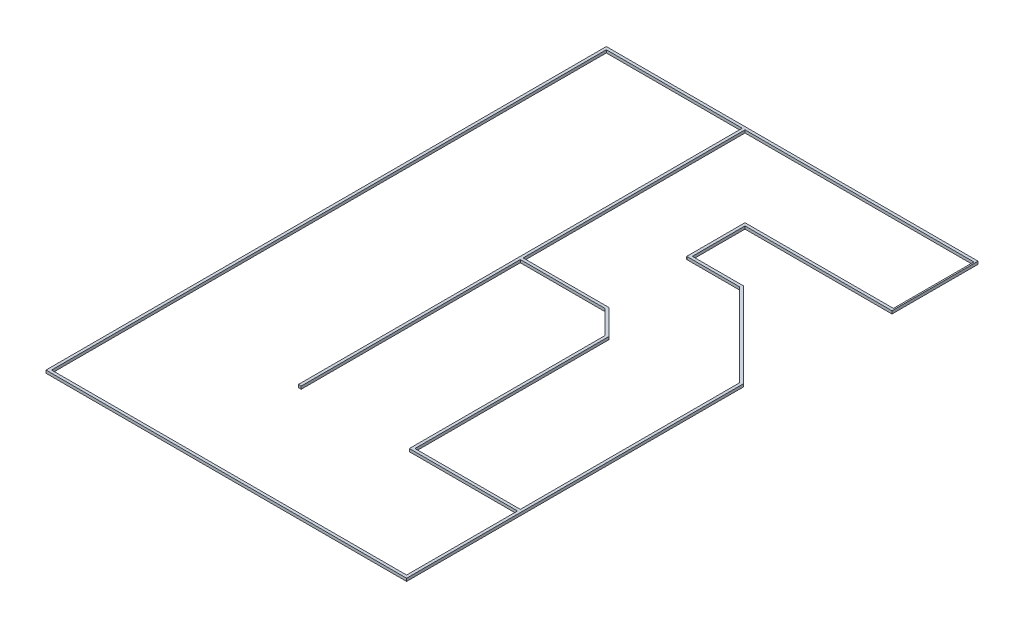
ISO-10303-21;
HEADER;
FILE_DESCRIPTION(('STEP AP214'),'2;1');
FILE_NAME('part.step','',(''),(''),'','','');
FILE_SCHEMA(('AUTOMOTIVE_DESIGN { 1 0 10303 214 1 1 1 1 }'));
ENDSEC;
DATA;
#1=APPLICATION_CONTEXT('core data for automotive mechanical design processes');
#2=APPLICATION_PROTOCOL_DEFINITION('international standard','automotive_design',2000,#1);
#3=PRODUCT_CONTEXT('',#1,'mechanical');
#4=PRODUCT('Part','Part','',(#3));
#5=PRODUCT_RELATED_PRODUCT_CATEGORY('part','',(#4));
#6=PRODUCT_DEFINITION_FORMATION('','',#4);
#7=PRODUCT_DEFINITION_CONTEXT('part definition',#1,'design');
#8=PRODUCT_DEFINITION('design','',#6,#7);
#9=PRODUCT_DEFINITION_SHAPE('','',#8);
#10=(LENGTH_UNIT() NAMED_UNIT(*) SI_UNIT(.MILLI.,.METRE.));
#11=(NAMED_UNIT(*) PLANE_ANGLE_UNIT() SI_UNIT($,.RADIAN.));
#12=(NAMED_UNIT(*) SI_UNIT($,.STERADIAN.) SOLID_ANGLE_UNIT());
#13=UNCERTAINTY_MEASURE_WITH_UNIT(LENGTH_MEASURE(1.E-05),#10,'distance_accuracy_value','');
#14=(GEOMETRIC_REPRESENTATION_CONTEXT(3) GLOBAL_UNCERTAINTY_ASSIGNED_CONTEXT((#13)) GLOBAL_UNIT_ASSIGNED_CONTEXT((#10,
#11,#12)) REPRESENTATION_CONTEXT('',''));
#15=CARTESIAN_POINT('',(0.,0.,0.));
#16=DIRECTION('',(0.,0.,1.));
#17=DIRECTION('',(1.,0.,0.));
#18=AXIS2_PLACEMENT_3D('',#15,#16,#17);
#19=CARTESIAN_POINT('',(0.,50.8,0.));
#20=DIRECTION('',(1.,0.,0.));
#21=DIRECTION('',(0.,0.,-1.));
#22=AXIS2_PLACEMENT_3D('',#19,#20,#21);
#23=PLANE('',#22);
#24=DIRECTION('',(0.,0.,1.));
#25=VECTOR('',#24,1.);
#26=CARTESIAN_POINT('',(0.,0.,0.));
#27=LINE('',#26,#25);
#28=CARTESIAN_POINT('',(0.,0.,-8170.51458234219));
#29=VERTEX_POINT('',#28);
#30=CARTESIAN_POINT('',(2.94505117041419E-13,0.,-6720.51458234219));
#31=VERTEX_POINT('',#30);
#32=EDGE_CURVE('E566',#29,#31,#27,.T.);
#33=ORIENTED_EDGE('',*,*,#32,.T.);
#34=DIRECTION('',(0.,-1.,0.));
#35=VECTOR('',#34,1.);
#36=CARTESIAN_POINT('',(2.94505117041419E-13,50.8,-6720.51458234219));
#37=LINE('',#36,#35);
#38=CARTESIAN_POINT('',(2.94505117041419E-13,50.8,-6720.51458234219));
#39=VERTEX_POINT('',#38);
#40=EDGE_CURVE('E11',#39,#31,#37,.T.);
#41=ORIENTED_EDGE('',*,*,#40,.F.);
#42=DIRECTION('',(0.,0.,1.));
#43=VECTOR('',#42,1.);
#44=CARTESIAN_POINT('',(0.,50.8,0.));
#45=LINE('',#44,#43);
#46=CARTESIAN_POINT('',(0.,50.8,-8170.51458234219));
#47=VERTEX_POINT('',#46);
#48=EDGE_CURVE('E398',#47,#39,#45,.T.);
#49=ORIENTED_EDGE('',*,*,#48,.F.);
#50=DIRECTION('',(0.,-1.,0.));
#51=VECTOR('',#50,1.);
#52=CARTESIAN_POINT('',(0.,50.8,-8170.51458234219));
#53=LINE('',#52,#51);
#54=EDGE_CURVE('E61',#47,#29,#53,.T.);
#55=ORIENTED_EDGE('',*,*,#54,.T.);
#56=EDGE_LOOP('',(#33,#41,#49,#55));
#57=FACE_BOUND('',#56,.T.);
#58=ADVANCED_FACE('F41',(#57),#23,.F.);
#59=CARTESIAN_POINT('',(0.,50.8,-6720.51458234219));
#60=DIRECTION('',(0.,0.,-1.));
#61=DIRECTION('',(-1.,0.,0.));
#62=AXIS2_PLACEMENT_3D('',#59,#60,#61);
#63=PLANE('',#62);
#64=DIRECTION('',(1.,0.,0.));
#65=VECTOR('',#64,1.);
#66=CARTESIAN_POINT('',(0.,0.,-6720.51458234219));
#67=LINE('',#66,#65);
#68=CARTESIAN_POINT('',(-2675.,0.,-6720.51458234219));
#69=VERTEX_POINT('',#68);
#70=EDGE_CURVE('E562',#69,#31,#67,.T.);
#71=ORIENTED_EDGE('',*,*,#70,.F.);
#72=DIRECTION('',(0.,-1.,0.));
#73=VECTOR('',#72,1.);
#74=CARTESIAN_POINT('',(-2675.,50.8,-6720.51458234219));
#75=LINE('',#74,#73);
#76=CARTESIAN_POINT('',(-2675.,50.8,-6720.51458234219));
#77=VERTEX_POINT('',#76);
#78=EDGE_CURVE('E52',#77,#69,#75,.T.);
#79=ORIENTED_EDGE('',*,*,#78,.F.);
#80=DIRECTION('',(1.,0.,0.));
#81=VECTOR('',#80,1.);
#82=CARTESIAN_POINT('',(0.,50.8,-6720.51458234219));
#83=LINE('',#82,#81);
#84=EDGE_CURVE('E394',#77,#39,#83,.T.);
#85=ORIENTED_EDGE('',*,*,#84,.T.);
#86=ORIENTED_EDGE('',*,*,#40,.T.);
#87=EDGE_LOOP('',(#71,#79,#85,#86));
#88=FACE_BOUND('',#87,.T.);
#89=ADVANCED_FACE('F645',(#88),#63,.T.);
#90=CARTESIAN_POINT('',(-2675.,50.8,0.));
#91=DIRECTION('',(-1.,0.,0.));
#92=DIRECTION('',(0.,0.,1.));
#93=AXIS2_PLACEMENT_3D('',#90,#91,#92);
#94=PLANE('',#93);
#95=DIRECTION('',(0.,0.,-1.));
#96=VECTOR('',#95,1.);
#97=CARTESIAN_POINT('',(-2675.,0.,0.));
#98=LINE('',#97,#96);
#99=CARTESIAN_POINT('',(-2675.,0.,-5670.51458234219));
#100=VERTEX_POINT('',#99);
#101=EDGE_CURVE('E558',#100,#69,#98,.T.);
#102=ORIENTED_EDGE('',*,*,#101,.F.);
#103=DIRECTION('',(0.,-1.,0.));
#104=VECTOR('',#103,1.);
#105=CARTESIAN_POINT('',(-2675.,50.8,-5670.51458234219));
#106=LINE('',#105,#104);
#107=CARTESIAN_POINT('',(-2675.,50.8,-5670.51458234219));
#108=VERTEX_POINT('',#107);
#109=EDGE_CURVE('E512',#108,#100,#106,.T.);
#110=ORIENTED_EDGE('',*,*,#109,.F.);
#111=DIRECTION('',(0.,0.,-1.));
#112=VECTOR('',#111,1.);
#113=CARTESIAN_POINT('',(-2675.,50.8,0.));
#114=LINE('',#113,#112);
#115=EDGE_CURVE('E390',#108,#77,#114,.T.);
#116=ORIENTED_EDGE('',*,*,#115,.T.);
#117=ORIENTED_EDGE('',*,*,#78,.T.);
#118=EDGE_LOOP('',(#102,#110,#116,#117));
#119=FACE_BOUND('',#118,.T.);
#120=ADVANCED_FACE('F650',(#119),#94,.T.);
#121=CARTESIAN_POINT('',(-5.30150387434863E-12,50.8,-5670.51458234219));
#122=DIRECTION('',(0.,0.,1.));
#123=DIRECTION('',(1.,0.,0.));
#124=AXIS2_PLACEMENT_3D('',#121,#122,#123);
#125=PLANE('',#124);
#126=DIRECTION('',(-1.,0.,0.));
#127=VECTOR('',#126,1.);
#128=CARTESIAN_POINT('',(-5.30150387434863E-12,0.,-5670.51458234219));
#129=LINE('',#128,#127);
#130=CARTESIAN_POINT('',(-1725.,0.,-5670.51458234219));
#131=VERTEX_POINT('',#130);
#132=EDGE_CURVE('E554',#131,#100,#129,.T.);
#133=ORIENTED_EDGE('',*,*,#132,.F.);
#134=DIRECTION('',(0.,-1.,0.));
#135=VECTOR('',#134,1.);
#136=CARTESIAN_POINT('',(-1725.,50.8,-5670.51458234219));
#137=LINE('',#136,#135);
#138=CARTESIAN_POINT('',(-1725.,50.8,-5670.51458234219));
#139=VERTEX_POINT('',#138);
#140=EDGE_CURVE('E515',#139,#131,#137,.T.);
#141=ORIENTED_EDGE('',*,*,#140,.F.);
#142=DIRECTION('',(-1.,0.,0.));
#143=VECTOR('',#142,1.);
#144=CARTESIAN_POINT('',(-5.30150387434863E-12,50.8,-5670.51458234219));
#145=LINE('',#144,#143);
#146=EDGE_CURVE('E386',#139,#108,#145,.T.);
#147=ORIENTED_EDGE('',*,*,#146,.T.);
#148=ORIENTED_EDGE('',*,*,#109,.T.);
#149=EDGE_LOOP('',(#133,#141,#147,#148));
#150=FACE_BOUND('',#149,.T.);
#151=ADVANCED_FACE('F727',(#150),#125,.T.);
#152=CARTESIAN_POINT('',(1972.7572911711,50.8,-1972.75729117109));
#153=DIRECTION('',(-0.707106781186548,0.,0.707106781186547));
#154=DIRECTION('',(0.707106781186547,0.,0.707106781186548));
#155=AXIS2_PLACEMENT_3D('',#152,#153,#154);
#156=PLANE('',#155);
#157=DIRECTION('',(-0.707106781186547,0.,-0.707106781186548));
#158=VECTOR('',#157,1.);
#159=CARTESIAN_POINT('',(1972.7572911711,0.,-1972.75729117109));
#160=LINE('',#159,#158);
#161=CARTESIAN_POINT('',(-224.999999999999,0.,-4170.51458234219));
#162=VERTEX_POINT('',#161);
#163=EDGE_CURVE('E550',#162,#131,#160,.T.);
#164=ORIENTED_EDGE('',*,*,#163,.F.);
#165=DIRECTION('',(0.,-1.,0.));
#166=VECTOR('',#165,1.);
#167=CARTESIAN_POINT('',(-224.999999999999,50.8,-4170.51458234219));
#168=LINE('',#167,#166);
#169=CARTESIAN_POINT('',(-224.999999999999,50.8,-4170.51458234219));
#170=VERTEX_POINT('',#169);
#171=EDGE_CURVE('E518',#170,#162,#168,.T.);
#172=ORIENTED_EDGE('',*,*,#171,.F.);
#173=DIRECTION('',(-0.707106781186547,0.,-0.707106781186548));
#174=VECTOR('',#173,1.);
#175=CARTESIAN_POINT('',(1972.7572911711,50.8,-1972.75729117109));
#176=LINE('',#175,#174);
#177=EDGE_CURVE('E382',#170,#139,#176,.T.);
#178=ORIENTED_EDGE('',*,*,#177,.T.);
#179=ORIENTED_EDGE('',*,*,#140,.T.);
#180=EDGE_LOOP('',(#164,#172,#178,#179));
#181=FACE_BOUND('',#180,.T.);
#182=ADVANCED_FACE('F723',(#181),#156,.T.);
#183=CARTESIAN_POINT('',(-224.999999999998,50.8,0.));
#184=DIRECTION('',(-1.,0.,0.));
#185=DIRECTION('',(0.,0.,1.));
#186=AXIS2_PLACEMENT_3D('',#183,#184,#185);
#187=PLANE('',#186);
#188=DIRECTION('',(0.,0.,-1.));
#189=VECTOR('',#188,1.);
#190=CARTESIAN_POINT('',(-224.999999999998,0.,0.));
#191=LINE('',#190,#189);
#192=CARTESIAN_POINT('',(-224.999999999998,0.,-220.514582342192));
#193=VERTEX_POINT('',#192);
#194=EDGE_CURVE('E364',#193,#162,#191,.T.);
#195=ORIENTED_EDGE('',*,*,#194,.F.);
#196=DIRECTION('',(0.,-1.,0.));
#197=VECTOR('',#196,1.);
#198=CARTESIAN_POINT('',(-224.999999999998,50.8,-220.514582342192));
#199=LINE('',#198,#197);
#200=CARTESIAN_POINT('',(-224.999999999998,50.8,-220.514582342192));
#201=VERTEX_POINT('',#200);
#202=EDGE_CURVE('E521',#201,#193,#199,.T.);
#203=ORIENTED_EDGE('',*,*,#202,.F.);
#204=DIRECTION('',(0.,0.,-1.));
#205=VECTOR('',#204,1.);
#206=CARTESIAN_POINT('',(-224.999999999998,50.8,0.));
#207=LINE('',#206,#205);
#208=EDGE_CURVE('E323',#201,#170,#207,.T.);
#209=ORIENTED_EDGE('',*,*,#208,.T.);
#210=ORIENTED_EDGE('',*,*,#171,.T.);
#211=EDGE_LOOP('',(#195,#203,#209,#210));
#212=FACE_BOUND('',#211,.T.);
#213=ADVANCED_FACE('F719',(#212),#187,.T.);
#214=CARTESIAN_POINT('',(0.,50.8,-220.514582342192));
#215=DIRECTION('',(0.,0.,-1.));
#216=DIRECTION('',(-1.,0.,0.));
#217=AXIS2_PLACEMENT_3D('',#214,#215,#216);
#218=PLANE('',#217);
#219=DIRECTION('',(1.,0.,0.));
#220=VECTOR('',#219,1.);
#221=CARTESIAN_POINT('',(0.,0.,-220.514582342192));
#222=LINE('',#221,#220);
#223=CARTESIAN_POINT('',(-2125.,0.,-220.514582342192));
#224=VERTEX_POINT('',#223);
#225=EDGE_CURVE('E546',#224,#193,#222,.T.);
#226=ORIENTED_EDGE('',*,*,#225,.F.);
#227=DIRECTION('',(0.,-1.,0.));
#228=VECTOR('',#227,1.);
#229=CARTESIAN_POINT('',(-2125.,50.8,-220.514582342192));
#230=LINE('',#229,#228);
#231=CARTESIAN_POINT('',(-2125.,50.8,-220.514582342192));
#232=VERTEX_POINT('',#231);
#233=EDGE_CURVE('E524',#232,#224,#230,.T.);
#234=ORIENTED_EDGE('',*,*,#233,.F.);
#235=DIRECTION('',(1.,0.,0.));
#236=VECTOR('',#235,1.);
#237=CARTESIAN_POINT('',(0.,50.8,-220.514582342192));
#238=LINE('',#237,#236);
#239=EDGE_CURVE('E378',#232,#201,#238,.T.);
#240=ORIENTED_EDGE('',*,*,#239,.T.);
#241=ORIENTED_EDGE('',*,*,#202,.T.);
#242=EDGE_LOOP('',(#226,#234,#240,#241));
#243=FACE_BOUND('',#242,.T.);
#244=ADVANCED_FACE('F715',(#243),#218,.T.);
#245=CARTESIAN_POINT('',(-2125.,50.8,0.));
#246=DIRECTION('',(1.,0.,0.));
#247=DIRECTION('',(0.,0.,-1.));
#248=AXIS2_PLACEMENT_3D('',#245,#246,#247);
#249=PLANE('',#248);
#250=DIRECTION('',(0.,0.,1.));
#251=VECTOR('',#250,1.);
#252=CARTESIAN_POINT('',(-2125.,0.,0.));
#253=LINE('',#252,#251);
#254=CARTESIAN_POINT('',(-2125.,0.,-3720.51458234219));
#255=VERTEX_POINT('',#254);
#256=EDGE_CURVE('E542',#255,#224,#253,.T.);
#257=ORIENTED_EDGE('',*,*,#256,.F.);
#258=DIRECTION('',(0.,-1.,0.));
#259=VECTOR('',#258,1.);
#260=CARTESIAN_POINT('',(-2125.,50.8,-3720.51458234219));
#261=LINE('',#260,#259);
#262=CARTESIAN_POINT('',(-2125.,50.8,-3720.51458234219));
#263=VERTEX_POINT('',#262);
#264=EDGE_CURVE('E527',#263,#255,#261,.T.);
#265=ORIENTED_EDGE('',*,*,#264,.F.);
#266=DIRECTION('',(0.,0.,1.));
#267=VECTOR('',#266,1.);
#268=CARTESIAN_POINT('',(-2125.,50.8,0.));
#269=LINE('',#268,#267);
#270=EDGE_CURVE('E374',#263,#232,#269,.T.);
#271=ORIENTED_EDGE('',*,*,#270,.T.);
#272=ORIENTED_EDGE('',*,*,#233,.T.);
#273=EDGE_LOOP('',(#257,#265,#271,#272));
#274=FACE_BOUND('',#273,.T.);
#275=ADVANCED_FACE('F709',(#274),#249,.T.);
#276=CARTESIAN_POINT('',(797.75729117109,50.8,-797.757291171086));
#277=DIRECTION('',(0.707106781186549,0.,-0.707106781186546));
#278=DIRECTION('',(-0.707106781186546,0.,-0.707106781186549));
#279=AXIS2_PLACEMENT_3D('',#276,#277,#278);
#280=PLANE('',#279);
#281=DIRECTION('',(0.707106781186546,0.,0.707106781186549));
#282=VECTOR('',#281,1.);
#283=CARTESIAN_POINT('',(797.75729117109,0.,-797.757291171086));
#284=LINE('',#283,#282);
#285=CARTESIAN_POINT('',(-2575.,0.,-4170.51458234219));
#286=VERTEX_POINT('',#285);
#287=EDGE_CURVE('E538',#286,#255,#284,.T.);
#288=ORIENTED_EDGE('',*,*,#287,.F.);
#289=DIRECTION('',(0.,-1.,0.));
#290=VECTOR('',#289,1.);
#291=CARTESIAN_POINT('',(-2575.,50.8,-4170.51458234219));
#292=LINE('',#291,#290);
#293=CARTESIAN_POINT('',(-2575.,50.8,-4170.51458234219));
#294=VERTEX_POINT('',#293);
#295=EDGE_CURVE('E269',#294,#286,#292,.T.);
#296=ORIENTED_EDGE('',*,*,#295,.F.);
#297=DIRECTION('',(0.707106781186546,0.,0.707106781186549));
#298=VECTOR('',#297,1.);
#299=CARTESIAN_POINT('',(797.75729117109,50.8,-797.757291171086));
#300=LINE('',#299,#298);
#301=EDGE_CURVE('E279',#294,#263,#300,.T.);
#302=ORIENTED_EDGE('',*,*,#301,.T.);
#303=ORIENTED_EDGE('',*,*,#264,.T.);
#304=EDGE_LOOP('',(#288,#296,#302,#303));
#305=FACE_BOUND('',#304,.T.);
#306=ADVANCED_FACE('F705',(#305),#280,.T.);
#307=CARTESIAN_POINT('',(0.,50.8,-4170.51458234219));
#308=DIRECTION('',(0.,0.,-1.));
#309=DIRECTION('',(-1.,0.,0.));
#310=AXIS2_PLACEMENT_3D('',#307,#308,#309);
#311=PLANE('',#310);
#312=DIRECTION('',(1.,0.,0.));
#313=VECTOR('',#312,1.);
#314=CARTESIAN_POINT('',(0.,0.,-4170.51458234219));
#315=LINE('',#314,#313);
#316=CARTESIAN_POINT('',(-4125.,0.,-4170.51458234219));
#317=VERTEX_POINT('',#316);
#318=EDGE_CURVE('E264',#317,#286,#315,.T.);
#319=ORIENTED_EDGE('',*,*,#318,.F.);
#320=DIRECTION('',(0.,-1.,0.));
#321=VECTOR('',#320,1.);
#322=CARTESIAN_POINT('',(-4125.,50.8,-4170.51458234219));
#323=LINE('',#322,#321);
#324=CARTESIAN_POINT('',(-4125.,50.8,-4170.51458234219));
#325=VERTEX_POINT('',#324);
#326=EDGE_CURVE('E259',#325,#317,#323,.T.);
#327=ORIENTED_EDGE('',*,*,#326,.F.);
#328=DIRECTION('',(1.,0.,0.));
#329=VECTOR('',#328,1.);
#330=CARTESIAN_POINT('',(0.,50.8,-4170.51458234219));
#331=LINE('',#330,#329);
#332=EDGE_CURVE('E262',#325,#294,#331,.T.);
#333=ORIENTED_EDGE('',*,*,#332,.T.);
#334=ORIENTED_EDGE('',*,*,#295,.T.);
#335=EDGE_LOOP('',(#319,#327,#333,#334));
#336=FACE_BOUND('',#335,.T.);
#337=ADVANCED_FACE('F261',(#336),#311,.T.);
#338=CARTESIAN_POINT('',(-4125.,50.8,4.57966997657877E-13));
#339=DIRECTION('',(1.,0.,0.));
#340=DIRECTION('',(0.,0.,-1.));
#341=AXIS2_PLACEMENT_3D('',#338,#339,#340);
#342=PLANE('',#341);
#343=DIRECTION('',(0.,0.,1.));
#344=VECTOR('',#343,1.);
#345=CARTESIAN_POINT('',(-4125.,0.,4.57966997657877E-13));
#346=LINE('',#345,#344);
#347=CARTESIAN_POINT('',(-4125.,0.,-8170.51458234219));
#348=VERTEX_POINT('',#347);
#349=EDGE_CURVE('E333',#348,#317,#346,.T.);
#350=ORIENTED_EDGE('',*,*,#349,.F.);
#351=DIRECTION('',(0.,-1.,0.));
#352=VECTOR('',#351,1.);
#353=CARTESIAN_POINT('',(-4125.,50.8,-8170.51458234219));
#354=LINE('',#353,#352);
#355=CARTESIAN_POINT('',(-4125.,50.8,-8170.51458234219));
#356=VERTEX_POINT('',#355);
#357=EDGE_CURVE('E158',#356,#348,#354,.T.);
#358=ORIENTED_EDGE('',*,*,#357,.F.);
#359=DIRECTION('',(0.,0.,1.));
#360=VECTOR('',#359,1.);
#361=CARTESIAN_POINT('',(-4125.,50.8,4.57966997657877E-13));
#362=LINE('',#361,#360);
#363=EDGE_CURVE('E276',#356,#325,#362,.T.);
#364=ORIENTED_EDGE('',*,*,#363,.T.);
#365=ORIENTED_EDGE('',*,*,#326,.T.);
#366=EDGE_LOOP('',(#350,#358,#364,#365));
#367=FACE_BOUND('',#366,.T.);
#368=ADVANCED_FACE('F282',(#367),#342,.T.);
#369=CARTESIAN_POINT('',(0.,50.8,-6670.51458234219));
#370=DIRECTION('',(0.,0.,-1.));
#371=DIRECTION('',(-1.,0.,0.));
#372=AXIS2_PLACEMENT_3D('',#369,#370,#371);
#373=PLANE('',#372);
#374=DIRECTION('',(1.,0.,0.));
#375=VECTOR('',#374,1.);
#376=CARTESIAN_POINT('',(0.,0.,-6670.51458234219));
#377=LINE('',#376,#375);
#378=CARTESIAN_POINT('',(-2625.,0.,-6670.51458234219));
#379=VERTEX_POINT('',#378);
#380=CARTESIAN_POINT('',(24.9999999999995,0.,-6670.51458234219));
#381=VERTEX_POINT('',#380);
#382=EDGE_CURVE('E594',#379,#381,#377,.T.);
#383=ORIENTED_EDGE('',*,*,#382,.T.);
#384=DIRECTION('',(0.,-1.,0.));
#385=VECTOR('',#384,1.);
#386=CARTESIAN_POINT('',(24.9999999999995,50.8,-6670.51458234219));
#387=LINE('',#386,#385);
#388=CARTESIAN_POINT('',(24.9999999999995,50.8,-6670.51458234219));
#389=VERTEX_POINT('',#388);
#390=EDGE_CURVE('E481',#389,#381,#387,.T.);
#391=ORIENTED_EDGE('',*,*,#390,.F.);
#392=DIRECTION('',(1.,0.,0.));
#393=VECTOR('',#392,1.);
#394=CARTESIAN_POINT('',(0.,50.8,-6670.51458234219));
#395=LINE('',#394,#393);
#396=CARTESIAN_POINT('',(-2625.,50.8,-6670.51458234219));
#397=VERTEX_POINT('',#396);
#398=EDGE_CURVE('E426',#397,#389,#395,.T.);
#399=ORIENTED_EDGE('',*,*,#398,.F.);
#400=DIRECTION('',(0.,-1.,0.));
#401=VECTOR('',#400,1.);
#402=CARTESIAN_POINT('',(-2625.,50.8,-6670.51458234219));
#403=LINE('',#402,#401);
#404=EDGE_CURVE('E447',#397,#379,#403,.T.);
#405=ORIENTED_EDGE('',*,*,#404,.T.);
#406=EDGE_LOOP('',(#383,#391,#399,#405));
#407=FACE_BOUND('',#406,.T.);
#408=ADVANCED_FACE('F686',(#407),#373,.F.);
#409=CARTESIAN_POINT('',(24.9999999999967,50.8,0.));
#410=DIRECTION('',(1.,0.,0.));
#411=DIRECTION('',(0.,0.,-1.));
#412=AXIS2_PLACEMENT_3D('',#409,#410,#411);
#413=PLANE('',#412);
#414=DIRECTION('',(0.,0.,1.));
#415=VECTOR('',#414,1.);
#416=CARTESIAN_POINT('',(24.9999999999967,0.,0.));
#417=LINE('',#416,#415);
#418=CARTESIAN_POINT('',(25.0000000000002,0.,-8220.51458234219));
#419=VERTEX_POINT('',#418);
#420=EDGE_CURVE('E590',#419,#381,#417,.T.);
#421=ORIENTED_EDGE('',*,*,#420,.F.);
#422=DIRECTION('',(0.,-1.,0.));
#423=VECTOR('',#422,1.);
#424=CARTESIAN_POINT('',(25.0000000000002,50.8,-8220.51458234219));
#425=LINE('',#424,#423);
#426=CARTESIAN_POINT('',(25.0000000000002,50.8,-8220.51458234219));
#427=VERTEX_POINT('',#426);
#428=EDGE_CURVE('E484',#427,#419,#425,.T.);
#429=ORIENTED_EDGE('',*,*,#428,.F.);
#430=DIRECTION('',(0.,0.,1.));
#431=VECTOR('',#430,1.);
#432=CARTESIAN_POINT('',(24.9999999999967,50.8,0.));
#433=LINE('',#432,#431);
#434=EDGE_CURVE('E422',#427,#389,#433,.T.);
#435=ORIENTED_EDGE('',*,*,#434,.T.);
#436=ORIENTED_EDGE('',*,*,#390,.T.);
#437=EDGE_LOOP('',(#421,#429,#435,#436));
#438=FACE_BOUND('',#437,.T.);
#439=ADVANCED_FACE('F682',(#438),#413,.T.);
#440=CARTESIAN_POINT('',(-2.18765053209484E-12,50.8,-8220.51458234219));
#441=DIRECTION('',(0.,0.,1.));
#442=DIRECTION('',(1.,0.,0.));
#443=AXIS2_PLACEMENT_3D('',#440,#441,#442);
#444=PLANE('',#443);
#445=DIRECTION('',(-1.,0.,0.));
#446=VECTOR('',#445,1.);
#447=CARTESIAN_POINT('',(-2.18765053209484E-12,0.,-8220.51458234219));
#448=LINE('',#447,#446);
#449=CARTESIAN_POINT('',(-6675.,0.,-8220.51458234219));
#450=VERTEX_POINT('',#449);
#451=EDGE_CURVE('E587',#419,#450,#448,.T.);
#452=ORIENTED_EDGE('',*,*,#451,.T.);
#453=DIRECTION('',(0.,-1.,0.));
#454=VECTOR('',#453,1.);
#455=CARTESIAN_POINT('',(-6675.,50.8,-8220.51458234219));
#456=LINE('',#455,#454);
#457=CARTESIAN_POINT('',(-6675.,50.8,-8220.51458234219));
#458=VERTEX_POINT('',#457);
#459=EDGE_CURVE('E487',#458,#450,#456,.T.);
#460=ORIENTED_EDGE('',*,*,#459,.F.);
#461=DIRECTION('',(-1.,0.,0.));
#462=VECTOR('',#461,1.);
#463=CARTESIAN_POINT('',(-2.18765053209484E-12,50.8,-8220.51458234219));
#464=LINE('',#463,#462);
#465=EDGE_CURVE('E419',#427,#458,#464,.T.);
#466=ORIENTED_EDGE('',*,*,#465,.F.);
#467=ORIENTED_EDGE('',*,*,#428,.T.);
#468=EDGE_LOOP('',(#452,#460,#466,#467));
#469=FACE_BOUND('',#468,.T.);
#470=ADVANCED_FACE('F678',(#469),#444,.F.);
#471=CARTESIAN_POINT('',(-6675.,50.8,5.86989203118647E-13));
#472=DIRECTION('',(1.,0.,0.));
#473=DIRECTION('',(0.,0.,-1.));
#474=AXIS2_PLACEMENT_3D('',#471,#472,#473);
#475=PLANE('',#474);
#476=DIRECTION('',(0.,0.,1.));
#477=VECTOR('',#476,1.);
#478=CARTESIAN_POINT('',(-6675.,0.,5.86989203118647E-13));
#479=LINE('',#478,#477);
#480=CARTESIAN_POINT('',(-6675.,0.,1879.48541765781));
#481=VERTEX_POINT('',#480);
#482=EDGE_CURVE('E584',#450,#481,#479,.T.);
#483=ORIENTED_EDGE('',*,*,#482,.T.);
#484=DIRECTION('',(0.,-1.,0.));
#485=VECTOR('',#484,1.);
#486=CARTESIAN_POINT('',(-6675.,50.8,1879.48541765781));
#487=LINE('',#486,#485);
#488=CARTESIAN_POINT('',(-6675.,50.8,1879.48541765781));
#489=VERTEX_POINT('',#488);
#490=EDGE_CURVE('E491',#489,#481,#487,.T.);
#491=ORIENTED_EDGE('',*,*,#490,.F.);
#492=DIRECTION('',(0.,0.,1.));
#493=VECTOR('',#492,1.);
#494=CARTESIAN_POINT('',(-6675.,50.8,5.86989203118647E-13));
#495=LINE('',#494,#493);
#496=EDGE_CURVE('E416',#458,#489,#495,.T.);
#497=ORIENTED_EDGE('',*,*,#496,.F.);
#498=ORIENTED_EDGE('',*,*,#459,.T.);
#499=EDGE_LOOP('',(#483,#491,#497,#498));
#500=FACE_BOUND('',#499,.T.);
#501=ADVANCED_FACE('F674',(#500),#475,.F.);
#502=CARTESIAN_POINT('',(0.,50.8,1879.48541765781));
#503=DIRECTION('',(0.,0.,-1.));
#504=DIRECTION('',(-1.,0.,0.));
#505=AXIS2_PLACEMENT_3D('',#502,#503,#504);
#506=PLANE('',#505);
#507=DIRECTION('',(1.,0.,0.));
#508=VECTOR('',#507,1.);
#509=CARTESIAN_POINT('',(0.,0.,1879.48541765781));
#510=LINE('',#509,#508);
#511=CARTESIAN_POINT('',(-174.999999999998,0.,1879.48541765781));
#512=VERTEX_POINT('',#511);
#513=EDGE_CURVE('E581',#481,#512,#510,.T.);
#514=ORIENTED_EDGE('',*,*,#513,.T.);
#515=DIRECTION('',(0.,-1.,0.));
#516=VECTOR('',#515,1.);
#517=CARTESIAN_POINT('',(-174.999999999998,50.8,1879.48541765781));
#518=LINE('',#517,#516);
#519=CARTESIAN_POINT('',(-174.999999999998,50.8,1879.48541765781));
#520=VERTEX_POINT('',#519);
#521=EDGE_CURVE('E495',#520,#512,#518,.T.);
#522=ORIENTED_EDGE('',*,*,#521,.F.);
#523=DIRECTION('',(1.,0.,0.));
#524=VECTOR('',#523,1.);
#525=CARTESIAN_POINT('',(0.,50.8,1879.48541765781));
#526=LINE('',#525,#524);
#527=EDGE_CURVE('E413',#489,#520,#526,.T.);
#528=ORIENTED_EDGE('',*,*,#527,.F.);
#529=ORIENTED_EDGE('',*,*,#490,.T.);
#530=EDGE_LOOP('',(#514,#522,#528,#529));
#531=FACE_BOUND('',#530,.T.);
#532=ADVANCED_FACE('F670',(#531),#506,.F.);
#533=CARTESIAN_POINT('',(-174.999999999998,50.8,0.));
#534=DIRECTION('',(-1.,0.,0.));
#535=DIRECTION('',(0.,0.,1.));
#536=AXIS2_PLACEMENT_3D('',#533,#534,#535);
#537=PLANE('',#536);
#538=DIRECTION('',(0.,0.,-1.));
#539=VECTOR('',#538,1.);
#540=CARTESIAN_POINT('',(-174.999999999998,0.,0.));
#541=LINE('',#540,#539);
#542=CARTESIAN_POINT('',(-174.999999999998,0.,-4191.22526046085));
#543=VERTEX_POINT('',#542);
#544=EDGE_CURVE('E578',#512,#543,#541,.T.);
#545=ORIENTED_EDGE('',*,*,#544,.T.);
#546=DIRECTION('',(0.,-1.,0.));
#547=VECTOR('',#546,1.);
#548=CARTESIAN_POINT('',(-174.999999999998,50.8,-4191.22526046085));
#549=LINE('',#548,#547);
#550=CARTESIAN_POINT('',(-174.999999999998,50.8,-4191.22526046085));
#551=VERTEX_POINT('',#550);
#552=EDGE_CURVE('E499',#551,#543,#549,.T.);
#553=ORIENTED_EDGE('',*,*,#552,.F.);
#554=DIRECTION('',(0.,0.,-1.));
#555=VECTOR('',#554,1.);
#556=CARTESIAN_POINT('',(-174.999999999998,50.8,0.));
#557=LINE('',#556,#555);
#558=EDGE_CURVE('E410',#520,#551,#557,.T.);
#559=ORIENTED_EDGE('',*,*,#558,.F.);
#560=ORIENTED_EDGE('',*,*,#521,.T.);
#561=EDGE_LOOP('',(#545,#553,#559,#560));
#562=FACE_BOUND('',#561,.T.);
#563=ADVANCED_FACE('F666',(#562),#537,.F.);
#564=CARTESIAN_POINT('',(2008.11263023042,50.8,-2008.11263023042));
#565=DIRECTION('',(-0.707106781186548,0.,0.707106781186547));
#566=DIRECTION('',(0.707106781186547,0.,0.707106781186548));
#567=AXIS2_PLACEMENT_3D('',#564,#565,#566);
#568=PLANE('',#567);
#569=DIRECTION('',(-0.707106781186547,0.,-0.707106781186548));
#570=VECTOR('',#569,1.);
#571=CARTESIAN_POINT('',(2008.11263023042,0.,-2008.11263023042));
#572=LINE('',#571,#570);
#573=CARTESIAN_POINT('',(-1704.28932188134,0.,-5720.51458234219));
#574=VERTEX_POINT('',#573);
#575=EDGE_CURVE('E575',#543,#574,#572,.T.);
#576=ORIENTED_EDGE('',*,*,#575,.T.);
#577=DIRECTION('',(0.,-1.,0.));
#578=VECTOR('',#577,1.);
#579=CARTESIAN_POINT('',(-1704.28932188134,50.8,-5720.51458234219));
#580=LINE('',#579,#578);
#581=CARTESIAN_POINT('',(-1704.28932188134,50.8,-5720.51458234219));
#582=VERTEX_POINT('',#581);
#583=EDGE_CURVE('E503',#582,#574,#580,.T.);
#584=ORIENTED_EDGE('',*,*,#583,.F.);
#585=DIRECTION('',(-0.707106781186547,0.,-0.707106781186548));
#586=VECTOR('',#585,1.);
#587=CARTESIAN_POINT('',(2008.11263023042,50.8,-2008.11263023042));
#588=LINE('',#587,#586);
#589=EDGE_CURVE('E407',#551,#582,#588,.T.);
#590=ORIENTED_EDGE('',*,*,#589,.F.);
#591=ORIENTED_EDGE('',*,*,#552,.T.);
#592=EDGE_LOOP('',(#576,#584,#590,#591));
#593=FACE_BOUND('',#592,.T.);
#594=ADVANCED_FACE('F662',(#593),#568,.F.);
#595=CARTESIAN_POINT('',(0.,50.8,-5720.51458234219));
#596=DIRECTION('',(0.,0.,1.));
#597=DIRECTION('',(1.,0.,0.));
#598=AXIS2_PLACEMENT_3D('',#595,#596,#597);
#599=PLANE('',#598);
#600=DIRECTION('',(-1.,0.,0.));
#601=VECTOR('',#600,1.);
#602=CARTESIAN_POINT('',(0.,0.,-5720.51458234219));
#603=LINE('',#602,#601);
#604=CARTESIAN_POINT('',(-2625.,0.,-5720.51458234219));
#605=VERTEX_POINT('',#604);
#606=EDGE_CURVE('E572',#574,#605,#603,.T.);
#607=ORIENTED_EDGE('',*,*,#606,.T.);
#608=DIRECTION('',(0.,-1.,0.));
#609=VECTOR('',#608,1.);
#610=CARTESIAN_POINT('',(-2625.,50.8,-5720.51458234219));
#611=LINE('',#610,#609);
#612=CARTESIAN_POINT('',(-2625.,50.8,-5720.51458234219));
#613=VERTEX_POINT('',#612);
#614=EDGE_CURVE('E452',#613,#605,#611,.T.);
#615=ORIENTED_EDGE('',*,*,#614,.F.);
#616=DIRECTION('',(-1.,0.,0.));
#617=VECTOR('',#616,1.);
#618=CARTESIAN_POINT('',(0.,50.8,-5720.51458234219));
#619=LINE('',#618,#617);
#620=EDGE_CURVE('E404',#582,#613,#619,.T.);
#621=ORIENTED_EDGE('',*,*,#620,.F.);
#622=ORIENTED_EDGE('',*,*,#583,.T.);
#623=EDGE_LOOP('',(#607,#615,#621,#622));
#624=FACE_BOUND('',#623,.T.);
#625=ADVANCED_FACE('F659',(#624),#599,.F.);
#626=CARTESIAN_POINT('',(-2175.,50.8,2.73679470094847E-13));
#627=DIRECTION('',(1.,0.,0.));
#628=DIRECTION('',(0.,0.,-1.));
#629=AXIS2_PLACEMENT_3D('',#626,#627,#628);
#630=PLANE('',#629);
#631=DIRECTION('',(0.,0.,1.));
#632=VECTOR('',#631,1.);
#633=CARTESIAN_POINT('',(-2175.,0.,2.73679470094847E-13));
#634=LINE('',#633,#632);
#635=CARTESIAN_POINT('',(-2175.,0.,-3699.80390422354));
#636=VERTEX_POINT('',#635);
#637=CARTESIAN_POINT('',(-2175.,0.,-170.514582342192));
#638=VERTEX_POINT('',#637);
#639=EDGE_CURVE('E368',#636,#638,#634,.T.);
#640=ORIENTED_EDGE('',*,*,#639,.T.);
#641=DIRECTION('',(0.,-1.,0.));
#642=VECTOR('',#641,1.);
#643=CARTESIAN_POINT('',(-2175.,50.8,-170.514582342192));
#644=LINE('',#643,#642);
#645=CARTESIAN_POINT('',(-2175.,50.8,-170.514582342192));
#646=VERTEX_POINT('',#645);
#647=EDGE_CURVE('E45',#646,#638,#644,.T.);
#648=ORIENTED_EDGE('',*,*,#647,.F.);
#649=DIRECTION('',(0.,0.,1.));
#650=VECTOR('',#649,1.);
#651=CARTESIAN_POINT('',(-2175.,50.8,2.73679470094847E-13));
#652=LINE('',#651,#650);
#653=CARTESIAN_POINT('',(-2175.,50.8,-3699.80390422354));
#654=VERTEX_POINT('',#653);
#655=EDGE_CURVE('E326',#654,#646,#652,.T.);
#656=ORIENTED_EDGE('',*,*,#655,.F.);
#657=DIRECTION('',(0.,-1.,0.));
#658=VECTOR('',#657,1.);
#659=CARTESIAN_POINT('',(-2175.,50.8,-3699.80390422354));
#660=LINE('',#659,#658);
#661=EDGE_CURVE('E288',#654,#636,#660,.T.);
#662=ORIENTED_EDGE('',*,*,#661,.T.);
#663=EDGE_LOOP('',(#640,#648,#656,#662));
#664=FACE_BOUND('',#663,.T.);
#665=ADVANCED_FACE('F43',(#664),#630,.F.);
#666=CARTESIAN_POINT('',(0.,50.8,-170.514582342192));
#667=DIRECTION('',(0.,0.,-1.));
#668=DIRECTION('',(-1.,0.,0.));
#669=AXIS2_PLACEMENT_3D('',#666,#667,#668);
#670=PLANE('',#669);
#671=DIRECTION('',(1.,0.,0.));
#672=VECTOR('',#671,1.);
#673=CARTESIAN_POINT('',(0.,0.,-170.514582342192));
#674=LINE('',#673,#672);
#675=CARTESIAN_POINT('',(-224.999999999998,0.,-170.514582342192));
#676=VERTEX_POINT('',#675);
#677=EDGE_CURVE('E363',#638,#676,#674,.T.);
#678=ORIENTED_EDGE('',*,*,#677,.T.);
#679=DIRECTION('',(0.,-1.,0.));
#680=VECTOR('',#679,1.);
#681=CARTESIAN_POINT('',(-224.999999999998,50.8,-170.514582342192));
#682=LINE('',#681,#680);
#683=CARTESIAN_POINT('',(-224.999999999998,50.8,-170.514582342192));
#684=VERTEX_POINT('',#683);
#685=EDGE_CURVE('E448',#684,#676,#682,.T.);
#686=ORIENTED_EDGE('',*,*,#685,.F.);
#687=DIRECTION('',(1.,0.,0.));
#688=VECTOR('',#687,1.);
#689=CARTESIAN_POINT('',(0.,50.8,-170.514582342192));
#690=LINE('',#689,#688);
#691=EDGE_CURVE('E171',#646,#684,#690,.T.);
#692=ORIENTED_EDGE('',*,*,#691,.F.);
#693=ORIENTED_EDGE('',*,*,#647,.T.);
#694=EDGE_LOOP('',(#678,#686,#692,#693));
#695=FACE_BOUND('',#694,.T.);
#696=ADVANCED_FACE('F618',(#695),#670,.F.);
#697=CARTESIAN_POINT('',(-224.999999999998,0.,1829.48541765781));
#698=VERTEX_POINT('',#697);
#699=EDGE_CURVE('E357',#698,#676,#191,.T.);
#700=ORIENTED_EDGE('',*,*,#699,.F.);
#701=DIRECTION('',(0.,-1.,0.));
#702=VECTOR('',#701,1.);
#703=CARTESIAN_POINT('',(-224.999999999998,50.8,1829.48541765781));
#704=LINE('',#703,#702);
#705=CARTESIAN_POINT('',(-224.999999999998,50.8,1829.48541765781));
#706=VERTEX_POINT('',#705);
#707=EDGE_CURVE('E454',#706,#698,#704,.T.);
#708=ORIENTED_EDGE('',*,*,#707,.F.);
#709=EDGE_CURVE('E319',#706,#684,#207,.T.);
#710=ORIENTED_EDGE('',*,*,#709,.T.);
#711=ORIENTED_EDGE('',*,*,#685,.T.);
#712=EDGE_LOOP('',(#700,#708,#710,#711));
#713=FACE_BOUND('',#712,.T.);
#714=ADVANCED_FACE('F620',(#713),#187,.T.);
#715=CARTESIAN_POINT('',(0.,50.8,1829.48541765781));
#716=DIRECTION('',(0.,0.,-1.));
#717=DIRECTION('',(-1.,0.,0.));
#718=AXIS2_PLACEMENT_3D('',#715,#716,#717);
#719=PLANE('',#718);
#720=DIRECTION('',(1.,0.,0.));
#721=VECTOR('',#720,1.);
#722=CARTESIAN_POINT('',(0.,0.,1829.48541765781));
#723=LINE('',#722,#721);
#724=CARTESIAN_POINT('',(-6625.,0.,1829.48541765781));
#725=VERTEX_POINT('',#724);
#726=EDGE_CURVE('E353',#725,#698,#723,.T.);
#727=ORIENTED_EDGE('',*,*,#726,.F.);
#728=DIRECTION('',(0.,-1.,0.));
#729=VECTOR('',#728,1.);
#730=CARTESIAN_POINT('',(-6625.,50.8,1829.48541765781));
#731=LINE('',#730,#729);
#732=CARTESIAN_POINT('',(-6625.,50.8,1829.48541765781));
#733=VERTEX_POINT('',#732);
#734=EDGE_CURVE('E458',#733,#725,#731,.T.);
#735=ORIENTED_EDGE('',*,*,#734,.F.);
#736=DIRECTION('',(1.,0.,0.));
#737=VECTOR('',#736,1.);
#738=CARTESIAN_POINT('',(0.,50.8,1829.48541765781));
#739=LINE('',#738,#737);
#740=EDGE_CURVE('E315',#733,#706,#739,.T.);
#741=ORIENTED_EDGE('',*,*,#740,.T.);
#742=ORIENTED_EDGE('',*,*,#707,.T.);
#743=EDGE_LOOP('',(#727,#735,#741,#742));
#744=FACE_BOUND('',#743,.T.);
#745=ADVANCED_FACE('F625',(#744),#719,.T.);
#746=CARTESIAN_POINT('',(-6625.,50.8,5.88418203051333E-13));
#747=DIRECTION('',(1.,0.,0.));
#748=DIRECTION('',(0.,0.,-1.));
#749=AXIS2_PLACEMENT_3D('',#746,#747,#748);
#750=PLANE('',#749);
#751=DIRECTION('',(0.,0.,1.));
#752=VECTOR('',#751,1.);
#753=CARTESIAN_POINT('',(-6625.,0.,5.88418203051333E-13));
#754=LINE('',#753,#752);
#755=CARTESIAN_POINT('',(-6625.,0.,-8170.51458234219));
#756=VERTEX_POINT('',#755);
#757=EDGE_CURVE('E345',#756,#725,#754,.T.);
#758=ORIENTED_EDGE('',*,*,#757,.F.);
#759=DIRECTION('',(0.,-1.,0.));
#760=VECTOR('',#759,1.);
#761=CARTESIAN_POINT('',(-6625.,50.8,-8170.51458234219));
#762=LINE('',#761,#760);
#763=CARTESIAN_POINT('',(-6625.,50.8,-8170.51458234219));
#764=VERTEX_POINT('',#763);
#765=EDGE_CURVE('E463',#764,#756,#762,.T.);
#766=ORIENTED_EDGE('',*,*,#765,.F.);
#767=DIRECTION('',(0.,0.,1.));
#768=VECTOR('',#767,1.);
#769=CARTESIAN_POINT('',(-6625.,50.8,5.88418203051333E-13));
#770=LINE('',#769,#768);
#771=EDGE_CURVE('E311',#764,#733,#770,.T.);
#772=ORIENTED_EDGE('',*,*,#771,.T.);
#773=ORIENTED_EDGE('',*,*,#734,.T.);
#774=EDGE_LOOP('',(#758,#766,#772,#773));
#775=FACE_BOUND('',#774,.T.);
#776=ADVANCED_FACE('F627',(#775),#750,.T.);
#777=CARTESIAN_POINT('',(-2.19075463543593E-12,50.8,-8170.51458234219));
#778=DIRECTION('',(0.,0.,1.));
#779=DIRECTION('',(1.,0.,0.));
#780=AXIS2_PLACEMENT_3D('',#777,#778,#779);
#781=PLANE('',#780);
#782=DIRECTION('',(-1.,0.,0.));
#783=VECTOR('',#782,1.);
#784=CARTESIAN_POINT('',(-2.19075463543593E-12,0.,-8170.51458234219));
#785=LINE('',#784,#783);
#786=CARTESIAN_POINT('',(-4175.,0.,-8170.51458234219));
#787=VERTEX_POINT('',#786);
#788=EDGE_CURVE('E335',#787,#756,#785,.T.);
#789=ORIENTED_EDGE('',*,*,#788,.F.);
#790=DIRECTION('',(0.,-1.,0.));
#791=VECTOR('',#790,1.);
#792=CARTESIAN_POINT('',(-4175.,50.8,-8170.51458234219));
#793=LINE('',#792,#791);
#794=CARTESIAN_POINT('',(-4175.,50.8,-8170.51458234219));
#795=VERTEX_POINT('',#794);
#796=EDGE_CURVE('E466',#795,#787,#793,.T.);
#797=ORIENTED_EDGE('',*,*,#796,.F.);
#798=DIRECTION('',(-1.,0.,0.));
#799=VECTOR('',#798,1.);
#800=CARTESIAN_POINT('',(-2.19075463543593E-12,50.8,-8170.51458234219));
#801=LINE('',#800,#799);
#802=EDGE_CURVE('E290',#795,#764,#801,.T.);
#803=ORIENTED_EDGE('',*,*,#802,.T.);
#804=ORIENTED_EDGE('',*,*,#765,.T.);
#805=EDGE_LOOP('',(#789,#797,#803,#804));
#806=FACE_BOUND('',#805,.T.);
#807=ADVANCED_FACE('F630',(#806),#781,.T.);
#808=CARTESIAN_POINT('',(-4175.,50.8,4.63518112781003E-13));
#809=DIRECTION('',(1.,0.,0.));
#810=DIRECTION('',(0.,0.,-1.));
#811=AXIS2_PLACEMENT_3D('',#808,#809,#810);
#812=PLANE('',#811);
#813=DIRECTION('',(0.,0.,1.));
#814=VECTOR('',#813,1.);
#815=CARTESIAN_POINT('',(-4175.,0.,4.63518112781003E-13));
#816=LINE('',#815,#814);
#817=CARTESIAN_POINT('',(-4175.,0.,-170.514582342192));
#818=VERTEX_POINT('',#817);
#819=EDGE_CURVE('E344',#787,#818,#816,.T.);
#820=ORIENTED_EDGE('',*,*,#819,.T.);
#821=DIRECTION('',(0.,-1.,0.));
#822=VECTOR('',#821,1.);
#823=CARTESIAN_POINT('',(-4175.,50.8,-170.514582342192));
#824=LINE('',#823,#822);
#825=CARTESIAN_POINT('',(-4175.,50.8,-170.514582342192));
#826=VERTEX_POINT('',#825);
#827=EDGE_CURVE('E469',#826,#818,#824,.T.);
#828=ORIENTED_EDGE('',*,*,#827,.F.);
#829=DIRECTION('',(0.,0.,1.));
#830=VECTOR('',#829,1.);
#831=CARTESIAN_POINT('',(-4175.,50.8,4.63518112781003E-13));
#832=LINE('',#831,#830);
#833=EDGE_CURVE('E302',#795,#826,#832,.T.);
#834=ORIENTED_EDGE('',*,*,#833,.F.);
#835=ORIENTED_EDGE('',*,*,#796,.T.);
#836=EDGE_LOOP('',(#820,#828,#834,#835));
#837=FACE_BOUND('',#836,.T.);
#838=ADVANCED_FACE('F633',(#837),#812,.F.);
#839=CARTESIAN_POINT('',(0.,50.8,-170.514582342192));
#840=DIRECTION('',(0.,0.,-1.));
#841=DIRECTION('',(-1.,0.,0.));
#842=AXIS2_PLACEMENT_3D('',#839,#840,#841);
#843=PLANE('',#842);
#844=DIRECTION('',(1.,0.,0.));
#845=VECTOR('',#844,1.);
#846=CARTESIAN_POINT('',(0.,0.,-170.514582342192));
#847=LINE('',#846,#845);
#848=CARTESIAN_POINT('',(-4125.,0.,-170.514582342192));
#849=VERTEX_POINT('',#848);
#850=EDGE_CURVE('E352',#818,#849,#847,.T.);
#851=ORIENTED_EDGE('',*,*,#850,.T.);
#852=DIRECTION('',(0.,-1.,0.));
#853=VECTOR('',#852,1.);
#854=CARTESIAN_POINT('',(-4125.,50.8,-170.514582342192));
#855=LINE('',#854,#853);
#856=CARTESIAN_POINT('',(-4125.,50.8,-170.514582342192));
#857=VERTEX_POINT('',#856);
#858=EDGE_CURVE('E473',#857,#849,#855,.T.);
#859=ORIENTED_EDGE('',*,*,#858,.F.);
#860=DIRECTION('',(1.,0.,0.));
#861=VECTOR('',#860,1.);
#862=CARTESIAN_POINT('',(0.,50.8,-170.514582342192));
#863=LINE('',#862,#861);
#864=EDGE_CURVE('E296',#826,#857,#863,.T.);
#865=ORIENTED_EDGE('',*,*,#864,.F.);
#866=ORIENTED_EDGE('',*,*,#827,.T.);
#867=EDGE_LOOP('',(#851,#859,#865,#866));
#868=FACE_BOUND('',#867,.T.);
#869=ADVANCED_FACE('F609',(#868),#843,.F.);
#870=CARTESIAN_POINT('',(-4125.,0.,-4120.51458234219));
#871=VERTEX_POINT('',#870);
#872=EDGE_CURVE('E339',#871,#849,#346,.T.);
#873=ORIENTED_EDGE('',*,*,#872,.F.);
#874=DIRECTION('',(0.,-1.,0.));
#875=VECTOR('',#874,1.);
#876=CARTESIAN_POINT('',(-4125.,50.8,-4120.51458234219));
#877=LINE('',#876,#875);
#878=CARTESIAN_POINT('',(-4125.,50.8,-4120.51458234219));
#879=VERTEX_POINT('',#878);
#880=EDGE_CURVE('E476',#879,#871,#877,.T.);
#881=ORIENTED_EDGE('',*,*,#880,.F.);
#882=EDGE_CURVE('E286',#879,#857,#362,.T.);
#883=ORIENTED_EDGE('',*,*,#882,.T.);
#884=ORIENTED_EDGE('',*,*,#858,.T.);
#885=EDGE_LOOP('',(#873,#881,#883,#884));
#886=FACE_BOUND('',#885,.T.);
#887=ADVANCED_FACE('F615',(#886),#342,.T.);
#888=CARTESIAN_POINT('',(0.,50.8,-4120.51458234219));
#889=DIRECTION('',(0.,0.,-1.));
#890=DIRECTION('',(-1.,0.,0.));
#891=AXIS2_PLACEMENT_3D('',#888,#889,#890);
#892=PLANE('',#891);
#893=DIRECTION('',(1.,0.,0.));
#894=VECTOR('',#893,1.);
#895=CARTESIAN_POINT('',(0.,0.,-4120.51458234219));
#896=LINE('',#895,#894);
#897=CARTESIAN_POINT('',(-2595.71067811865,0.,-4120.51458234219));
#898=VERTEX_POINT('',#897);
#899=EDGE_CURVE('E600',#871,#898,#896,.T.);
#900=ORIENTED_EDGE('',*,*,#899,.T.);
#901=DIRECTION('',(0.,-1.,0.));
#902=VECTOR('',#901,1.);
#903=CARTESIAN_POINT('',(-2595.71067811865,50.8,-4120.51458234219));
#904=LINE('',#903,#902);
#905=CARTESIAN_POINT('',(-2595.71067811865,50.8,-4120.51458234219));
#906=VERTEX_POINT('',#905);
#907=EDGE_CURVE('E444',#906,#898,#904,.T.);
#908=ORIENTED_EDGE('',*,*,#907,.F.);
#909=DIRECTION('',(1.,0.,0.));
#910=VECTOR('',#909,1.);
#911=CARTESIAN_POINT('',(0.,50.8,-4120.51458234219));
#912=LINE('',#911,#910);
#913=EDGE_CURVE('E295',#879,#906,#912,.T.);
#914=ORIENTED_EDGE('',*,*,#913,.F.);
#915=ORIENTED_EDGE('',*,*,#880,.T.);
#916=EDGE_LOOP('',(#900,#908,#914,#915));
#917=FACE_BOUND('',#916,.T.);
#918=ADVANCED_FACE('F617',(#917),#892,.F.);
#919=CARTESIAN_POINT('',(-2625.,50.8,0.));
#920=DIRECTION('',(-1.,0.,0.));
#921=DIRECTION('',(0.,0.,1.));
#922=AXIS2_PLACEMENT_3D('',#919,#920,#921);
#923=PLANE('',#922);
#924=DIRECTION('',(0.,0.,-1.));
#925=VECTOR('',#924,1.);
#926=CARTESIAN_POINT('',(-2625.,0.,0.));
#927=LINE('',#926,#925);
#928=EDGE_CURVE('E569',#605,#379,#927,.T.);
#929=ORIENTED_EDGE('',*,*,#928,.T.);
#930=ORIENTED_EDGE('',*,*,#404,.F.);
#931=DIRECTION('',(0.,0.,-1.));
#932=VECTOR('',#931,1.);
#933=CARTESIAN_POINT('',(-2625.,50.8,0.));
#934=LINE('',#933,#932);
#935=EDGE_CURVE('E401',#613,#397,#934,.T.);
#936=ORIENTED_EDGE('',*,*,#935,.F.);
#937=ORIENTED_EDGE('',*,*,#614,.T.);
#938=EDGE_LOOP('',(#929,#930,#936,#937));
#939=FACE_BOUND('',#938,.T.);
#940=ADVANCED_FACE('F655',(#939),#923,.F.);
#941=CARTESIAN_POINT('',(762.401952111762,50.8,-762.401952111759));
#942=DIRECTION('',(0.707106781186549,0.,-0.707106781186546));
#943=DIRECTION('',(-0.707106781186546,0.,-0.707106781186549));
#944=AXIS2_PLACEMENT_3D('',#941,#942,#943);
#945=PLANE('',#944);
#946=DIRECTION('',(0.707106781186546,0.,0.707106781186549));
#947=VECTOR('',#946,1.);
#948=CARTESIAN_POINT('',(762.401952111762,0.,-762.401952111759));
#949=LINE('',#948,#947);
#950=EDGE_CURVE('E440',#898,#636,#949,.T.);
#951=ORIENTED_EDGE('',*,*,#950,.T.);
#952=ORIENTED_EDGE('',*,*,#661,.F.);
#953=DIRECTION('',(0.707106781186546,0.,0.707106781186549));
#954=VECTOR('',#953,1.);
#955=CARTESIAN_POINT('',(762.401952111762,50.8,-762.401952111759));
#956=LINE('',#955,#954);
#957=EDGE_CURVE('E301',#906,#654,#956,.T.);
#958=ORIENTED_EDGE('',*,*,#957,.F.);
#959=ORIENTED_EDGE('',*,*,#907,.T.);
#960=EDGE_LOOP('',(#951,#952,#958,#959));
#961=FACE_BOUND('',#960,.T.);
#962=ADVANCED_FACE('F438',(#961),#945,.F.);
#963=EDGE_CURVE('E328',#29,#348,#785,.T.);
#964=ORIENTED_EDGE('',*,*,#963,.F.);
#965=ORIENTED_EDGE('',*,*,#54,.F.);
#966=EDGE_CURVE('E284',#47,#356,#801,.T.);
#967=ORIENTED_EDGE('',*,*,#966,.T.);
#968=ORIENTED_EDGE('',*,*,#357,.T.);
#969=EDGE_LOOP('',(#964,#965,#967,#968));
#970=FACE_BOUND('',#969,.T.);
#971=ADVANCED_FACE('F642',(#970),#781,.T.);
#972=CARTESIAN_POINT('',(0.,50.8,0.));
#973=DIRECTION('',(0.,1.,0.));
#974=DIRECTION('',(0.,0.,1.));
#975=AXIS2_PLACEMENT_3D('',#972,#973,#974);
#976=PLANE('',#975);
#977=ORIENTED_EDGE('',*,*,#655,.T.);
#978=ORIENTED_EDGE('',*,*,#691,.T.);
#979=ORIENTED_EDGE('',*,*,#709,.F.);
#980=ORIENTED_EDGE('',*,*,#740,.F.);
#981=ORIENTED_EDGE('',*,*,#771,.F.);
#982=ORIENTED_EDGE('',*,*,#802,.F.);
#983=ORIENTED_EDGE('',*,*,#833,.T.);
#984=ORIENTED_EDGE('',*,*,#864,.T.);
#985=ORIENTED_EDGE('',*,*,#882,.F.);
#986=ORIENTED_EDGE('',*,*,#913,.T.);
#987=ORIENTED_EDGE('',*,*,#957,.T.);
#988=EDGE_LOOP('',(#977,#978,#979,#980,#981,#982,#983,#984,#985,#986,#987));
#989=FACE_BOUND('',#988,.T.);
#990=ORIENTED_EDGE('',*,*,#398,.T.);
#991=ORIENTED_EDGE('',*,*,#434,.F.);
#992=ORIENTED_EDGE('',*,*,#465,.T.);
#993=ORIENTED_EDGE('',*,*,#496,.T.);
#994=ORIENTED_EDGE('',*,*,#527,.T.);
#995=ORIENTED_EDGE('',*,*,#558,.T.);
#996=ORIENTED_EDGE('',*,*,#589,.T.);
#997=ORIENTED_EDGE('',*,*,#620,.T.);
#998=ORIENTED_EDGE('',*,*,#935,.T.);
#999=EDGE_LOOP('',(#990,#991,#992,#993,#994,#995,#996,#997,#998));
#1000=FACE_BOUND('',#999,.T.);
#1001=ORIENTED_EDGE('',*,*,#48,.T.);
#1002=ORIENTED_EDGE('',*,*,#84,.F.);
#1003=ORIENTED_EDGE('',*,*,#115,.F.);
#1004=ORIENTED_EDGE('',*,*,#146,.F.);
#1005=ORIENTED_EDGE('',*,*,#177,.F.);
#1006=ORIENTED_EDGE('',*,*,#208,.F.);
#1007=ORIENTED_EDGE('',*,*,#239,.F.);
#1008=ORIENTED_EDGE('',*,*,#270,.F.);
#1009=ORIENTED_EDGE('',*,*,#301,.F.);
#1010=ORIENTED_EDGE('',*,*,#332,.F.);
#1011=ORIENTED_EDGE('',*,*,#363,.F.);
#1012=ORIENTED_EDGE('',*,*,#966,.F.);
#1013=EDGE_LOOP('',(#1001,#1002,#1003,#1004,#1005,#1006,#1007,#1008,#1009,#1010,#1011,#1012));
#1014=FACE_BOUND('',#1013,.T.);
#1015=ADVANCED_FACE('F274',(#989,#1000,#1014),#976,.T.);
#1016=CARTESIAN_POINT('',(0.,0.,0.));
#1017=DIRECTION('',(0.,1.,0.));
#1018=DIRECTION('',(0.,0.,1.));
#1019=AXIS2_PLACEMENT_3D('',#1016,#1017,#1018);
#1020=PLANE('',#1019);
#1021=ORIENTED_EDGE('',*,*,#639,.F.);
#1022=ORIENTED_EDGE('',*,*,#950,.F.);
#1023=ORIENTED_EDGE('',*,*,#899,.F.);
#1024=ORIENTED_EDGE('',*,*,#872,.T.);
#1025=ORIENTED_EDGE('',*,*,#850,.F.);
#1026=ORIENTED_EDGE('',*,*,#819,.F.);
#1027=ORIENTED_EDGE('',*,*,#788,.T.);
#1028=ORIENTED_EDGE('',*,*,#757,.T.);
#1029=ORIENTED_EDGE('',*,*,#726,.T.);
#1030=ORIENTED_EDGE('',*,*,#699,.T.);
#1031=ORIENTED_EDGE('',*,*,#677,.F.);
#1032=EDGE_LOOP('',(#1021,#1022,#1023,#1024,#1025,#1026,#1027,#1028,#1029,#1030,#1031));
#1033=FACE_BOUND('',#1032,.T.);
#1034=ORIENTED_EDGE('',*,*,#382,.F.);
#1035=ORIENTED_EDGE('',*,*,#928,.F.);
#1036=ORIENTED_EDGE('',*,*,#606,.F.);
#1037=ORIENTED_EDGE('',*,*,#575,.F.);
#1038=ORIENTED_EDGE('',*,*,#544,.F.);
#1039=ORIENTED_EDGE('',*,*,#513,.F.);
#1040=ORIENTED_EDGE('',*,*,#482,.F.);
#1041=ORIENTED_EDGE('',*,*,#451,.F.);
#1042=ORIENTED_EDGE('',*,*,#420,.T.);
#1043=EDGE_LOOP('',(#1034,#1035,#1036,#1037,#1038,#1039,#1040,#1041,#1042));
#1044=FACE_BOUND('',#1043,.T.);
#1045=ORIENTED_EDGE('',*,*,#32,.F.);
#1046=ORIENTED_EDGE('',*,*,#963,.T.);
#1047=ORIENTED_EDGE('',*,*,#349,.T.);
#1048=ORIENTED_EDGE('',*,*,#318,.T.);
#1049=ORIENTED_EDGE('',*,*,#287,.T.);
#1050=ORIENTED_EDGE('',*,*,#256,.T.);
#1051=ORIENTED_EDGE('',*,*,#225,.T.);
#1052=ORIENTED_EDGE('',*,*,#194,.T.);
#1053=ORIENTED_EDGE('',*,*,#163,.T.);
#1054=ORIENTED_EDGE('',*,*,#132,.T.);
#1055=ORIENTED_EDGE('',*,*,#101,.T.);
#1056=ORIENTED_EDGE('',*,*,#70,.T.);
#1057=EDGE_LOOP('',(#1045,#1046,#1047,#1048,#1049,#1050,#1051,#1052,#1053,#1054,#1055,#1056));
#1058=FACE_BOUND('',#1057,.T.);
#1059=ADVANCED_FACE('F613',(#1033,#1044,#1058),#1020,.F.);
#1060=CLOSED_SHELL('',(#58,#89,#120,#151,#182,#213,#244,#275,#306,#337,#368,#408,#439,#470,#501,
#532,#563,#594,#625,#665,#696,#714,#745,#776,#807,#838,#869,#887,#918,#940,#962,#971,#1015,#1059));
#1061=MANIFOLD_SOLID_BREP('B2',#1060);
#1062=ADVANCED_BREP_SHAPE_REPRESENTATION('',(#18,#1061),#14);
#1063=SHAPE_DEFINITION_REPRESENTATION(#9,#1062);
ENDSEC;
END-ISO-10303-21;
